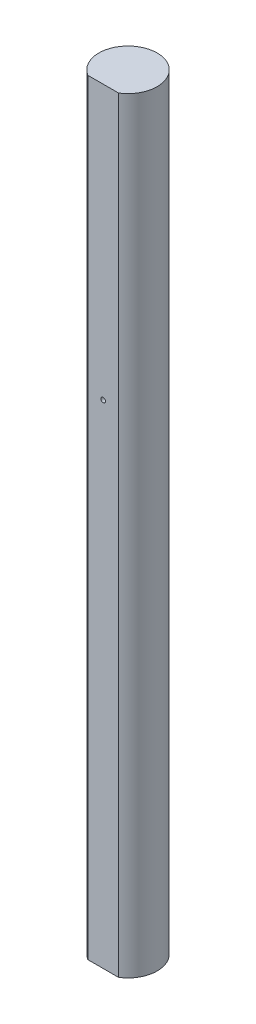
ISO-10303-21;
HEADER;
FILE_DESCRIPTION(('STEP AP214'),'2;1');
FILE_NAME('part.step','',(''),(''),'','','');
FILE_SCHEMA(('AUTOMOTIVE_DESIGN { 1 0 10303 214 1 1 1 1 }'));
ENDSEC;
DATA;
#1=APPLICATION_CONTEXT('core data for automotive mechanical design processes');
#2=APPLICATION_PROTOCOL_DEFINITION('international standard','automotive_design',2000,#1);
#3=PRODUCT_CONTEXT('',#1,'mechanical');
#4=PRODUCT('Part','Part','',(#3));
#5=PRODUCT_RELATED_PRODUCT_CATEGORY('part','',(#4));
#6=PRODUCT_DEFINITION_FORMATION('','',#4);
#7=PRODUCT_DEFINITION_CONTEXT('part definition',#1,'design');
#8=PRODUCT_DEFINITION('design','',#6,#7);
#9=PRODUCT_DEFINITION_SHAPE('','',#8);
#10=(LENGTH_UNIT() NAMED_UNIT(*) SI_UNIT(.MILLI.,.METRE.));
#11=(NAMED_UNIT(*) PLANE_ANGLE_UNIT() SI_UNIT($,.RADIAN.));
#12=(NAMED_UNIT(*) SI_UNIT($,.STERADIAN.) SOLID_ANGLE_UNIT());
#13=UNCERTAINTY_MEASURE_WITH_UNIT(LENGTH_MEASURE(1.E-05),#10,'distance_accuracy_value','');
#14=(GEOMETRIC_REPRESENTATION_CONTEXT(3) GLOBAL_UNCERTAINTY_ASSIGNED_CONTEXT((#13)) GLOBAL_UNIT_ASSIGNED_CONTEXT((#10,
#11,#12)) REPRESENTATION_CONTEXT('',''));
#15=CARTESIAN_POINT('',(0.,0.,0.));
#16=DIRECTION('',(0.,0.,1.));
#17=DIRECTION('',(1.,0.,0.));
#18=AXIS2_PLACEMENT_3D('',#15,#16,#17);
#19=CARTESIAN_POINT('',(0.,500.,0.));
#20=DIRECTION('',(0.,-1.,0.));
#21=DIRECTION('',(0.,0.,-1.));
#22=AXIS2_PLACEMENT_3D('',#19,#20,#21);
#23=CYLINDRICAL_SURFACE('',#22,19.05);
#24=CARTESIAN_POINT('',(0.,0.,0.));
#25=DIRECTION('',(0.,1.,0.));
#26=DIRECTION('',(0.,0.,1.));
#27=AXIS2_PLACEMENT_3D('',#24,#25,#26);
#28=CIRCLE('',#27,19.05);
#29=CARTESIAN_POINT('',(10.,0.,16.2142684077944));
#30=VERTEX_POINT('',#29);
#31=CARTESIAN_POINT('',(-10.,0.,16.2142684077944));
#32=VERTEX_POINT('',#31);
#33=EDGE_CURVE('E88',#30,#32,#28,.T.);
#34=ORIENTED_EDGE('',*,*,#33,.T.);
#35=DIRECTION('',(0.,-1.,0.));
#36=VECTOR('',#35,1.);
#37=CARTESIAN_POINT('',(-10.,500.,16.2142684077944));
#38=LINE('',#37,#36);
#39=CARTESIAN_POINT('',(-10.,500.,16.2142684077944));
#40=VERTEX_POINT('',#39);
#41=EDGE_CURVE('E11',#40,#32,#38,.T.);
#42=ORIENTED_EDGE('',*,*,#41,.F.);
#43=CARTESIAN_POINT('',(0.,500.,0.));
#44=DIRECTION('',(0.,1.,0.));
#45=DIRECTION('',(0.,0.,1.));
#46=AXIS2_PLACEMENT_3D('',#43,#44,#45);
#47=CIRCLE('',#46,19.05);
#48=CARTESIAN_POINT('',(10.,500.,16.2142684077944));
#49=VERTEX_POINT('',#48);
#50=EDGE_CURVE('E90',#49,#40,#47,.T.);
#51=ORIENTED_EDGE('',*,*,#50,.F.);
#52=DIRECTION('',(0.,-1.,0.));
#53=VECTOR('',#52,1.);
#54=CARTESIAN_POINT('',(10.,500.,16.2142684077944));
#55=LINE('',#54,#53);
#56=EDGE_CURVE('E48',#49,#30,#55,.T.);
#57=ORIENTED_EDGE('',*,*,#56,.T.);
#58=EDGE_LOOP('',(#34,#42,#51,#57));
#59=FACE_BOUND('',#58,.T.);
#60=ADVANCED_FACE('F40',(#59),#23,.T.);
#61=CARTESIAN_POINT('',(-10.,500.,16.2142684077944));
#62=DIRECTION('',(0.,0.,-1.));
#63=DIRECTION('',(-1.,0.,0.));
#64=AXIS2_PLACEMENT_3D('',#61,#62,#63);
#65=PLANE('',#64);
#66=CARTESIAN_POINT('',(0.,321.4,16.2142684077944));
#67=DIRECTION('',(0.,0.,1.));
#68=DIRECTION('',(1.,0.,0.));
#69=AXIS2_PLACEMENT_3D('',#66,#67,#68);
#70=CIRCLE('',#69,1.5);
#71=CARTESIAN_POINT('',(1.5,321.4,16.2142684077944));
#72=VERTEX_POINT('',#71);
#73=EDGE_CURVE('E78',#72,#72,#70,.T.);
#74=ORIENTED_EDGE('',*,*,#73,.F.);
#75=EDGE_LOOP('',(#74));
#76=FACE_BOUND('',#75,.T.);
#77=DIRECTION('',(1.,0.,0.));
#78=VECTOR('',#77,1.);
#79=CARTESIAN_POINT('',(-10.,0.,16.2142684077944));
#80=LINE('',#79,#78);
#81=EDGE_CURVE('E65',#32,#30,#80,.T.);
#82=ORIENTED_EDGE('',*,*,#81,.T.);
#83=ORIENTED_EDGE('',*,*,#56,.F.);
#84=DIRECTION('',(1.,0.,0.));
#85=VECTOR('',#84,1.);
#86=CARTESIAN_POINT('',(-10.,500.,16.2142684077944));
#87=LINE('',#86,#85);
#88=EDGE_CURVE('E55',#40,#49,#87,.T.);
#89=ORIENTED_EDGE('',*,*,#88,.F.);
#90=ORIENTED_EDGE('',*,*,#41,.T.);
#91=EDGE_LOOP('',(#82,#83,#89,#90));
#92=FACE_BOUND('',#91,.T.);
#93=ADVANCED_FACE('F112',(#76,#92),#65,.F.);
#94=CARTESIAN_POINT('',(0.,500.,0.));
#95=DIRECTION('',(0.,1.,0.));
#96=DIRECTION('',(0.,0.,1.));
#97=AXIS2_PLACEMENT_3D('',#94,#95,#96);
#98=PLANE('',#97);
#99=ORIENTED_EDGE('',*,*,#50,.T.);
#100=ORIENTED_EDGE('',*,*,#88,.T.);
#101=EDGE_LOOP('',(#99,#100));
#102=FACE_BOUND('',#101,.T.);
#103=ADVANCED_FACE('F103',(#102),#98,.T.);
#104=CARTESIAN_POINT('',(0.,0.,0.));
#105=DIRECTION('',(0.,1.,0.));
#106=DIRECTION('',(0.,0.,1.));
#107=AXIS2_PLACEMENT_3D('',#104,#105,#106);
#108=PLANE('',#107);
#109=CARTESIAN_POINT('',(0.,0.,0.));
#110=DIRECTION('',(0.,-1.,0.));
#111=DIRECTION('',(0.,0.,-1.));
#112=AXIS2_PLACEMENT_3D('',#109,#110,#111);
#113=CIRCLE('',#112,2.09999999999999);
#114=CARTESIAN_POINT('',(0.,0.,-2.09999999999999));
#115=VERTEX_POINT('',#114);
#116=EDGE_CURVE('E79',#115,#115,#113,.T.);
#117=ORIENTED_EDGE('',*,*,#116,.F.);
#118=EDGE_LOOP('',(#117));
#119=FACE_BOUND('',#118,.T.);
#120=ORIENTED_EDGE('',*,*,#33,.F.);
#121=ORIENTED_EDGE('',*,*,#81,.F.);
#122=EDGE_LOOP('',(#120,#121));
#123=FACE_BOUND('',#122,.T.);
#124=ADVANCED_FACE('F100',(#119,#123),#108,.F.);
#125=CARTESIAN_POINT('',(0.,321.4,11.2142684077944));
#126=DIRECTION('',(0.,0.,1.));
#127=DIRECTION('',(1.,0.,0.));
#128=AXIS2_PLACEMENT_3D('',#125,#126,#127);
#129=CYLINDRICAL_SURFACE('',#128,1.5);
#130=CARTESIAN_POINT('',(0.,321.4,11.2142684077944));
#131=DIRECTION('',(0.,0.,1.));
#132=DIRECTION('',(1.,0.,0.));
#133=AXIS2_PLACEMENT_3D('',#130,#131,#132);
#134=CIRCLE('',#133,1.5);
#135=CARTESIAN_POINT('',(1.5,321.4,11.2142684077944));
#136=VERTEX_POINT('',#135);
#137=EDGE_CURVE('E82',#136,#136,#134,.T.);
#138=ORIENTED_EDGE('',*,*,#137,.F.);
#139=EDGE_LOOP('',(#138));
#140=FACE_BOUND('',#139,.T.);
#141=ORIENTED_EDGE('',*,*,#73,.T.);
#142=EDGE_LOOP('',(#141));
#143=FACE_BOUND('',#142,.T.);
#144=ADVANCED_FACE('F102',(#140,#143),#129,.F.);
#145=CARTESIAN_POINT('',(0.,321.4,11.2142684077944));
#146=DIRECTION('',(0.,0.,1.));
#147=DIRECTION('',(1.,0.,0.));
#148=AXIS2_PLACEMENT_3D('',#145,#146,#147);
#149=PLANE('',#148);
#150=ORIENTED_EDGE('',*,*,#137,.T.);
#151=EDGE_LOOP('',(#150));
#152=FACE_BOUND('',#151,.T.);
#153=ADVANCED_FACE('F72',(#152),#149,.T.);
#154=CARTESIAN_POINT('',(0.,10.,0.));
#155=DIRECTION('',(0.,-1.,0.));
#156=DIRECTION('',(0.,0.,-1.));
#157=AXIS2_PLACEMENT_3D('',#154,#155,#156);
#158=CONICAL_SURFACE('',#157,2.1,1.02974425867665);
#159=CARTESIAN_POINT('',(0.,11.2618072999579,0.));
#160=VERTEX_POINT('',#159);
#161=VERTEX_LOOP('',#160);
#162=FACE_BOUND('',#161,.T.);
#163=CARTESIAN_POINT('',(0.,10.,0.));
#164=DIRECTION('',(0.,-1.,0.));
#165=DIRECTION('',(0.,0.,-1.));
#166=AXIS2_PLACEMENT_3D('',#163,#164,#165);
#167=CIRCLE('',#166,2.1);
#168=CARTESIAN_POINT('',(0.,10.,-2.1));
#169=VERTEX_POINT('',#168);
#170=EDGE_CURVE('E76',#169,#169,#167,.T.);
#171=ORIENTED_EDGE('',*,*,#170,.T.);
#172=EDGE_LOOP('',(#171));
#173=FACE_BOUND('',#172,.T.);
#174=ADVANCED_FACE('F68',(#162,#173),#158,.F.);
#175=CARTESIAN_POINT('',(0.,0.,0.));
#176=DIRECTION('',(0.,-1.,0.));
#177=DIRECTION('',(0.,0.,-1.));
#178=AXIS2_PLACEMENT_3D('',#175,#176,#177);
#179=CYLINDRICAL_SURFACE('',#178,2.09999999999999);
#180=ORIENTED_EDGE('',*,*,#170,.F.);
#181=EDGE_LOOP('',(#180));
#182=FACE_BOUND('',#181,.T.);
#183=ORIENTED_EDGE('',*,*,#116,.T.);
#184=EDGE_LOOP('',(#183));
#185=FACE_BOUND('',#184,.T.);
#186=ADVANCED_FACE('F71',(#182,#185),#179,.F.);
#187=CLOSED_SHELL('',(#60,#93,#103,#124,#144,#153,#174,#186));
#188=MANIFOLD_SOLID_BREP('B2',#187);
#189=ADVANCED_BREP_SHAPE_REPRESENTATION('',(#18,#188),#14);
#190=SHAPE_DEFINITION_REPRESENTATION(#9,#189);
ENDSEC;
END-ISO-10303-21;
